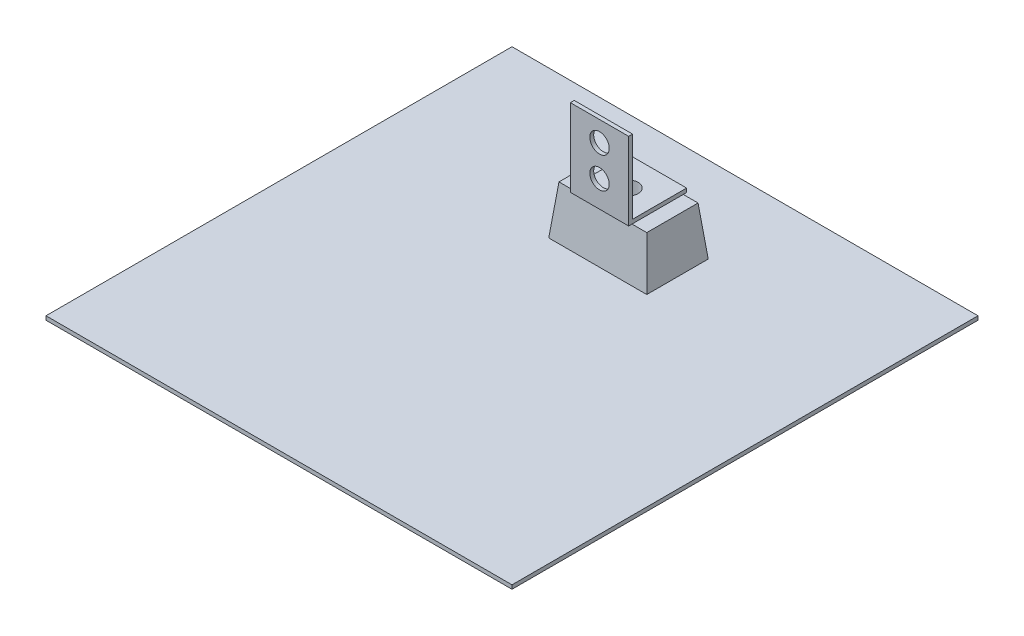
ISO-10303-21;
HEADER;
FILE_DESCRIPTION(('STEP AP214'),'2;1');
FILE_NAME('part.step','',(''),(''),'','','');
FILE_SCHEMA(('AUTOMOTIVE_DESIGN { 1 0 10303 214 1 1 1 1 }'));
ENDSEC;
DATA;
#1=APPLICATION_CONTEXT('core data for automotive mechanical design processes');
#2=APPLICATION_PROTOCOL_DEFINITION('international standard','automotive_design',2000,#1);
#3=PRODUCT_CONTEXT('',#1,'mechanical');
#4=PRODUCT('Part','Part','',(#3));
#5=PRODUCT_RELATED_PRODUCT_CATEGORY('part','',(#4));
#6=PRODUCT_DEFINITION_FORMATION('','',#4);
#7=PRODUCT_DEFINITION_CONTEXT('part definition',#1,'design');
#8=PRODUCT_DEFINITION('design','',#6,#7);
#9=PRODUCT_DEFINITION_SHAPE('','',#8);
#10=(LENGTH_UNIT() NAMED_UNIT(*) SI_UNIT(.MILLI.,.METRE.));
#11=(NAMED_UNIT(*) PLANE_ANGLE_UNIT() SI_UNIT($,.RADIAN.));
#12=(NAMED_UNIT(*) SI_UNIT($,.STERADIAN.) SOLID_ANGLE_UNIT());
#13=UNCERTAINTY_MEASURE_WITH_UNIT(LENGTH_MEASURE(1.E-05),#10,'distance_accuracy_value','');
#14=(GEOMETRIC_REPRESENTATION_CONTEXT(3) GLOBAL_UNCERTAINTY_ASSIGNED_CONTEXT((#13)) GLOBAL_UNIT_ASSIGNED_CONTEXT((#10,
#11,#12)) REPRESENTATION_CONTEXT('',''));
#15=CARTESIAN_POINT('',(0.,0.,0.));
#16=DIRECTION('',(0.,0.,1.));
#17=DIRECTION('',(1.,0.,0.));
#18=AXIS2_PLACEMENT_3D('',#15,#16,#17);
#19=CARTESIAN_POINT('',(0.,34.29,0.));
#20=DIRECTION('',(0.,-1.,0.));
#21=DIRECTION('',(0.,0.,-1.));
#22=AXIS2_PLACEMENT_3D('',#19,#20,#21);
#23=PLANE('',#22);
#24=DIRECTION('',(0.,0.,-1.));
#25=VECTOR('',#24,1.);
#26=CARTESIAN_POINT('',(171.45,34.29,-209.648741009424));
#27=LINE('',#26,#25);
#28=CARTESIAN_POINT('',(171.45,34.29,-211.830517437258));
#29=VERTEX_POINT('',#28);
#30=CARTESIAN_POINT('',(171.45,34.29,-245.369482562742));
#31=VERTEX_POINT('',#30);
#32=EDGE_CURVE('E11',#29,#31,#27,.T.);
#33=ORIENTED_EDGE('',*,*,#32,.F.);
#34=DIRECTION('',(-1.,0.,0.));
#35=VECTOR('',#34,1.);
#36=CARTESIAN_POINT('',(0.,34.29,-211.830517437258));
#37=LINE('',#36,#35);
#38=CARTESIAN_POINT('',(181.117842591182,34.29,-211.830517437258));
#39=VERTEX_POINT('',#38);
#40=EDGE_CURVE('E280',#29,#39,#37,.F.);
#41=ORIENTED_EDGE('',*,*,#40,.T.);
#42=DIRECTION('',(0.,0.,1.));
#43=VECTOR('',#42,1.);
#44=CARTESIAN_POINT('',(181.117842591182,34.29,0.));
#45=LINE('',#44,#43);
#46=CARTESIAN_POINT('',(181.117842591182,34.29,-245.369482562742));
#47=VERTEX_POINT('',#46);
#48=EDGE_CURVE('E250',#39,#47,#45,.F.);
#49=ORIENTED_EDGE('',*,*,#48,.T.);
#50=DIRECTION('',(1.,0.,0.));
#51=VECTOR('',#50,1.);
#52=CARTESIAN_POINT('',(0.,34.29,-245.369482562742));
#53=LINE('',#52,#51);
#54=EDGE_CURVE('E272',#47,#31,#53,.F.);
#55=ORIENTED_EDGE('',*,*,#54,.T.);
#56=EDGE_LOOP('',(#33,#41,#49,#55));
#57=FACE_BOUND('',#56,.T.);
#58=ADVANCED_FACE('F39',(#57),#23,.F.);
#59=CARTESIAN_POINT('',(0.,2.54,0.));
#60=DIRECTION('',(0.,-1.,0.));
#61=DIRECTION('',(0.,0.,-1.));
#62=AXIS2_PLACEMENT_3D('',#59,#60,#61);
#63=PLANE('',#62);
#64=DIRECTION('',(0.,0.,1.));
#65=VECTOR('',#64,1.);
#66=CARTESIAN_POINT('',(0.,2.54,0.));
#67=LINE('',#66,#65);
#68=CARTESIAN_POINT('',(0.,2.54,-304.8));
#69=VERTEX_POINT('',#68);
#70=CARTESIAN_POINT('',(0.,2.54,0.));
#71=VERTEX_POINT('',#70);
#72=EDGE_CURVE('E285',#69,#71,#67,.T.);
#73=ORIENTED_EDGE('',*,*,#72,.T.);
#74=DIRECTION('',(1.,0.,0.));
#75=VECTOR('',#74,1.);
#76=CARTESIAN_POINT('',(0.,2.54,0.));
#77=LINE('',#76,#75);
#78=CARTESIAN_POINT('',(304.8,2.54,0.));
#79=VERTEX_POINT('',#78);
#80=EDGE_CURVE('E289',#71,#79,#77,.T.);
#81=ORIENTED_EDGE('',*,*,#80,.T.);
#82=DIRECTION('',(0.,0.,-1.));
#83=VECTOR('',#82,1.);
#84=CARTESIAN_POINT('',(304.8,2.54,0.));
#85=LINE('',#84,#83);
#86=CARTESIAN_POINT('',(304.8,2.54,-304.8));
#87=VERTEX_POINT('',#86);
#88=EDGE_CURVE('E293',#79,#87,#85,.T.);
#89=ORIENTED_EDGE('',*,*,#88,.T.);
#90=DIRECTION('',(-1.,0.,0.));
#91=VECTOR('',#90,1.);
#92=CARTESIAN_POINT('',(0.,2.54,-304.8));
#93=LINE('',#92,#91);
#94=EDGE_CURVE('E296',#87,#69,#93,.T.);
#95=ORIENTED_EDGE('',*,*,#94,.T.);
#96=EDGE_LOOP('',(#73,#81,#89,#95));
#97=FACE_BOUND('',#96,.T.);
#98=DIRECTION('',(0.,0.,-1.));
#99=VECTOR('',#98,1.);
#100=CARTESIAN_POINT('',(184.454902060867,2.54,-208.493457967573));
#101=LINE('',#100,#99);
#102=CARTESIAN_POINT('',(184.454902060867,2.54,-208.493457967573));
#103=VERTEX_POINT('',#102);
#104=CARTESIAN_POINT('',(184.454902060867,2.54,-248.706542032427));
#105=VERTEX_POINT('',#104);
#106=EDGE_CURVE('E225',#103,#105,#101,.T.);
#107=ORIENTED_EDGE('',*,*,#106,.F.);
#108=DIRECTION('',(1.,0.,0.));
#109=VECTOR('',#108,1.);
#110=CARTESIAN_POINT('',(120.345097939133,2.54,-208.493457967573));
#111=LINE('',#110,#109);
#112=CARTESIAN_POINT('',(120.345097939133,2.54,-208.493457967573));
#113=VERTEX_POINT('',#112);
#114=EDGE_CURVE('E246',#113,#103,#111,.T.);
#115=ORIENTED_EDGE('',*,*,#114,.F.);
#116=DIRECTION('',(0.,0.,1.));
#117=VECTOR('',#116,1.);
#118=CARTESIAN_POINT('',(120.345097939133,2.54,-208.493457967573));
#119=LINE('',#118,#117);
#120=CARTESIAN_POINT('',(120.345097939133,2.54,-248.706542032427));
#121=VERTEX_POINT('',#120);
#122=EDGE_CURVE('E242',#121,#113,#119,.T.);
#123=ORIENTED_EDGE('',*,*,#122,.F.);
#124=DIRECTION('',(-1.,0.,0.));
#125=VECTOR('',#124,1.);
#126=CARTESIAN_POINT('',(120.345097939133,2.54,-248.706542032427));
#127=LINE('',#126,#125);
#128=EDGE_CURVE('E67',#105,#121,#127,.T.);
#129=ORIENTED_EDGE('',*,*,#128,.F.);
#130=EDGE_LOOP('',(#107,#115,#123,#129));
#131=FACE_BOUND('',#130,.T.);
#132=ADVANCED_FACE('F363',(#97,#131),#63,.F.);
#133=CARTESIAN_POINT('',(0.,2.54,0.));
#134=DIRECTION('',(1.,0.,0.));
#135=DIRECTION('',(0.,0.,-1.));
#136=AXIS2_PLACEMENT_3D('',#133,#134,#135);
#137=PLANE('',#136);
#138=DIRECTION('',(0.,0.,1.));
#139=VECTOR('',#138,1.);
#140=CARTESIAN_POINT('',(0.,0.,0.));
#141=LINE('',#140,#139);
#142=CARTESIAN_POINT('',(0.,0.,-304.8));
#143=VERTEX_POINT('',#142);
#144=CARTESIAN_POINT('',(0.,0.,0.));
#145=VERTEX_POINT('',#144);
#146=EDGE_CURVE('E254',#143,#145,#141,.T.);
#147=ORIENTED_EDGE('',*,*,#146,.T.);
#148=DIRECTION('',(0.,-1.,0.));
#149=VECTOR('',#148,1.);
#150=CARTESIAN_POINT('',(0.,2.54,0.));
#151=LINE('',#150,#149);
#152=EDGE_CURVE('E322',#71,#145,#151,.T.);
#153=ORIENTED_EDGE('',*,*,#152,.F.);
#154=ORIENTED_EDGE('',*,*,#72,.F.);
#155=DIRECTION('',(0.,-1.,0.));
#156=VECTOR('',#155,1.);
#157=CARTESIAN_POINT('',(0.,2.54,-304.8));
#158=LINE('',#157,#156);
#159=EDGE_CURVE('E299',#69,#143,#158,.T.);
#160=ORIENTED_EDGE('',*,*,#159,.T.);
#161=EDGE_LOOP('',(#147,#153,#154,#160));
#162=FACE_BOUND('',#161,.T.);
#163=ADVANCED_FACE('F41',(#162),#137,.F.);
#164=CARTESIAN_POINT('',(0.,2.54,0.));
#165=DIRECTION('',(0.,0.,-1.));
#166=DIRECTION('',(-1.,0.,0.));
#167=AXIS2_PLACEMENT_3D('',#164,#165,#166);
#168=PLANE('',#167);
#169=DIRECTION('',(1.,0.,0.));
#170=VECTOR('',#169,1.);
#171=CARTESIAN_POINT('',(0.,0.,0.));
#172=LINE('',#171,#170);
#173=CARTESIAN_POINT('',(304.8,0.,0.));
#174=VERTEX_POINT('',#173);
#175=EDGE_CURVE('E303',#145,#174,#172,.T.);
#176=ORIENTED_EDGE('',*,*,#175,.T.);
#177=DIRECTION('',(0.,-1.,0.));
#178=VECTOR('',#177,1.);
#179=CARTESIAN_POINT('',(304.8,2.54,0.));
#180=LINE('',#179,#178);
#181=EDGE_CURVE('E318',#79,#174,#180,.T.);
#182=ORIENTED_EDGE('',*,*,#181,.F.);
#183=ORIENTED_EDGE('',*,*,#80,.F.);
#184=ORIENTED_EDGE('',*,*,#152,.T.);
#185=EDGE_LOOP('',(#176,#182,#183,#184));
#186=FACE_BOUND('',#185,.T.);
#187=ADVANCED_FACE('F430',(#186),#168,.F.);
#188=CARTESIAN_POINT('',(304.8,2.54,0.));
#189=DIRECTION('',(-1.,0.,0.));
#190=DIRECTION('',(0.,0.,1.));
#191=AXIS2_PLACEMENT_3D('',#188,#189,#190);
#192=PLANE('',#191);
#193=DIRECTION('',(0.,0.,-1.));
#194=VECTOR('',#193,1.);
#195=CARTESIAN_POINT('',(304.8,0.,0.));
#196=LINE('',#195,#194);
#197=CARTESIAN_POINT('',(304.8,0.,-304.8));
#198=VERTEX_POINT('',#197);
#199=EDGE_CURVE('E306',#174,#198,#196,.T.);
#200=ORIENTED_EDGE('',*,*,#199,.T.);
#201=DIRECTION('',(0.,-1.,0.));
#202=VECTOR('',#201,1.);
#203=CARTESIAN_POINT('',(304.8,2.54,-304.8));
#204=LINE('',#203,#202);
#205=EDGE_CURVE('E314',#87,#198,#204,.T.);
#206=ORIENTED_EDGE('',*,*,#205,.F.);
#207=ORIENTED_EDGE('',*,*,#88,.F.);
#208=ORIENTED_EDGE('',*,*,#181,.T.);
#209=EDGE_LOOP('',(#200,#206,#207,#208));
#210=FACE_BOUND('',#209,.T.);
#211=ADVANCED_FACE('F427',(#210),#192,.F.);
#212=CARTESIAN_POINT('',(0.,2.54,-304.8));
#213=DIRECTION('',(0.,0.,1.));
#214=DIRECTION('',(1.,0.,0.));
#215=AXIS2_PLACEMENT_3D('',#212,#213,#214);
#216=PLANE('',#215);
#217=DIRECTION('',(-1.,0.,0.));
#218=VECTOR('',#217,1.);
#219=CARTESIAN_POINT('',(0.,0.,-304.8));
#220=LINE('',#219,#218);
#221=EDGE_CURVE('E290',#198,#143,#220,.T.);
#222=ORIENTED_EDGE('',*,*,#221,.T.);
#223=ORIENTED_EDGE('',*,*,#159,.F.);
#224=ORIENTED_EDGE('',*,*,#94,.F.);
#225=ORIENTED_EDGE('',*,*,#205,.T.);
#226=EDGE_LOOP('',(#222,#223,#224,#225));
#227=FACE_BOUND('',#226,.T.);
#228=ADVANCED_FACE('F423',(#227),#216,.F.);
#229=CARTESIAN_POINT('',(0.,0.,0.));
#230=DIRECTION('',(0.,-1.,0.));
#231=DIRECTION('',(0.,0.,-1.));
#232=AXIS2_PLACEMENT_3D('',#229,#230,#231);
#233=PLANE('',#232);
#234=CARTESIAN_POINT('',(152.4,0.,-228.6));
#235=DIRECTION('',(0.,-1.,0.));
#236=DIRECTION('',(0.,0.,-1.));
#237=AXIS2_PLACEMENT_3D('',#234,#235,#236);
#238=CIRCLE('',#237,6.34999999999999);
#239=CARTESIAN_POINT('',(152.4,0.,-234.95));
#240=VERTEX_POINT('',#239);
#241=EDGE_CURVE('E183',#240,#240,#238,.T.);
#242=ORIENTED_EDGE('',*,*,#241,.F.);
#243=EDGE_LOOP('',(#242));
#244=FACE_BOUND('',#243,.T.);
#245=ORIENTED_EDGE('',*,*,#146,.F.);
#246=ORIENTED_EDGE('',*,*,#221,.F.);
#247=ORIENTED_EDGE('',*,*,#199,.F.);
#248=ORIENTED_EDGE('',*,*,#175,.F.);
#249=EDGE_LOOP('',(#245,#246,#247,#248));
#250=FACE_BOUND('',#249,.T.);
#251=ADVANCED_FACE('F420',(#244,#250),#233,.T.);
#252=CARTESIAN_POINT('',(184.454902060867,2.54,-208.493457967573));
#253=DIRECTION('',(0.994521895368273,0.104528463267653,0.));
#254=DIRECTION('',(-0.104528463267653,0.994521895368273,0.));
#255=AXIS2_PLACEMENT_3D('',#252,#253,#254);
#256=PLANE('',#255);
#257=ORIENTED_EDGE('',*,*,#106,.T.);
#258=DIRECTION('',(0.103962051184498,-0.989132844377854,-0.103962051184498));
#259=VECTOR('',#258,1.);
#260=CARTESIAN_POINT('',(183.761996368515,9.13255728943549,-248.013636340076));
#261=LINE('',#260,#259);
#262=EDGE_CURVE('E251',#47,#105,#261,.T.);
#263=ORIENTED_EDGE('',*,*,#262,.F.);
#264=ORIENTED_EDGE('',*,*,#48,.F.);
#265=DIRECTION('',(0.103962051184498,-0.989132844377854,0.103962051184498));
#266=VECTOR('',#265,1.);
#267=CARTESIAN_POINT('',(184.454902060867,2.54,-208.493457967573));
#268=LINE('',#267,#266);
#269=EDGE_CURVE('E256',#39,#103,#268,.T.);
#270=ORIENTED_EDGE('',*,*,#269,.T.);
#271=EDGE_LOOP('',(#257,#263,#264,#270));
#272=FACE_BOUND('',#271,.T.);
#273=ADVANCED_FACE('F404',(#272),#256,.T.);
#274=CARTESIAN_POINT('',(120.345097939133,2.54,-248.706542032427));
#275=DIRECTION('',(0.,0.104528463267653,-0.994521895368273));
#276=DIRECTION('',(0.,0.994521895368273,0.104528463267653));
#277=AXIS2_PLACEMENT_3D('',#274,#275,#276);
#278=PLANE('',#277);
#279=ORIENTED_EDGE('',*,*,#128,.T.);
#280=DIRECTION('',(-0.103962051184498,-0.989132844377854,-0.103962051184498));
#281=VECTOR('',#280,1.);
#282=CARTESIAN_POINT('',(120.779725298197,6.67520309591098,-248.271914673363));
#283=LINE('',#282,#281);
#284=CARTESIAN_POINT('',(123.682157408818,34.29,-245.369482562742));
#285=VERTEX_POINT('',#284);
#286=EDGE_CURVE('E255',#285,#121,#283,.T.);
#287=ORIENTED_EDGE('',*,*,#286,.F.);
#288=CARTESIAN_POINT('',(133.35,34.29,-245.369482562742));
#289=VERTEX_POINT('',#288);
#290=EDGE_CURVE('E271',#289,#285,#53,.F.);
#291=ORIENTED_EDGE('',*,*,#290,.F.);
#292=EDGE_CURVE('E277',#31,#289,#53,.F.);
#293=ORIENTED_EDGE('',*,*,#292,.F.);
#294=ORIENTED_EDGE('',*,*,#54,.F.);
#295=ORIENTED_EDGE('',*,*,#262,.T.);
#296=EDGE_LOOP('',(#279,#287,#291,#293,#294,#295));
#297=FACE_BOUND('',#296,.T.);
#298=ADVANCED_FACE('F406',(#297),#278,.T.);
#299=CARTESIAN_POINT('',(120.345097939133,2.54,-208.493457967573));
#300=DIRECTION('',(-0.994521895368273,0.104528463267653,0.));
#301=DIRECTION('',(-0.104528463267653,-0.994521895368273,0.));
#302=AXIS2_PLACEMENT_3D('',#299,#300,#301);
#303=PLANE('',#302);
#304=ORIENTED_EDGE('',*,*,#122,.T.);
#305=DIRECTION('',(-0.103962051184498,-0.989132844377854,0.103962051184498));
#306=VECTOR('',#305,1.);
#307=CARTESIAN_POINT('',(120.345097939133,2.54,-208.493457967573));
#308=LINE('',#307,#306);
#309=CARTESIAN_POINT('',(123.682157408818,34.29,-211.830517437258));
#310=VERTEX_POINT('',#309);
#311=EDGE_CURVE('E260',#310,#113,#308,.T.);
#312=ORIENTED_EDGE('',*,*,#311,.F.);
#313=DIRECTION('',(0.,0.,-1.));
#314=VECTOR('',#313,1.);
#315=CARTESIAN_POINT('',(123.682157408818,34.29,0.));
#316=LINE('',#315,#314);
#317=EDGE_CURVE('E276',#285,#310,#316,.F.);
#318=ORIENTED_EDGE('',*,*,#317,.F.);
#319=ORIENTED_EDGE('',*,*,#286,.T.);
#320=EDGE_LOOP('',(#304,#312,#318,#319));
#321=FACE_BOUND('',#320,.T.);
#322=ADVANCED_FACE('F386',(#321),#303,.T.);
#323=CARTESIAN_POINT('',(120.345097939133,2.54,-208.493457967573));
#324=DIRECTION('',(0.,0.104528463267653,0.994521895368273));
#325=DIRECTION('',(0.,-0.994521895368273,0.104528463267653));
#326=AXIS2_PLACEMENT_3D('',#323,#324,#325);
#327=PLANE('',#326);
#328=ORIENTED_EDGE('',*,*,#114,.T.);
#329=ORIENTED_EDGE('',*,*,#269,.F.);
#330=ORIENTED_EDGE('',*,*,#40,.F.);
#331=CARTESIAN_POINT('',(133.35,34.29,-211.830517437258));
#332=VERTEX_POINT('',#331);
#333=EDGE_CURVE('E284',#332,#29,#37,.F.);
#334=ORIENTED_EDGE('',*,*,#333,.F.);
#335=EDGE_CURVE('E261',#310,#332,#37,.F.);
#336=ORIENTED_EDGE('',*,*,#335,.F.);
#337=ORIENTED_EDGE('',*,*,#311,.T.);
#338=EDGE_LOOP('',(#328,#329,#330,#334,#336,#337));
#339=FACE_BOUND('',#338,.T.);
#340=ADVANCED_FACE('F378',(#339),#327,.T.);
#341=ORIENTED_EDGE('',*,*,#335,.T.);
#342=DIRECTION('',(0.,0.,-1.));
#343=VECTOR('',#342,1.);
#344=CARTESIAN_POINT('',(133.35,34.29,-209.648741009424));
#345=LINE('',#344,#343);
#346=EDGE_CURVE('E49',#332,#289,#345,.T.);
#347=ORIENTED_EDGE('',*,*,#346,.T.);
#348=ORIENTED_EDGE('',*,*,#290,.T.);
#349=ORIENTED_EDGE('',*,*,#317,.T.);
#350=EDGE_LOOP('',(#341,#347,#348,#349));
#351=FACE_BOUND('',#350,.T.);
#352=ADVANCED_FACE('F366',(#351),#23,.F.);
#353=CARTESIAN_POINT('',(171.45,0.,0.));
#354=DIRECTION('',(1.,0.,0.));
#355=DIRECTION('',(0.,0.,-1.));
#356=AXIS2_PLACEMENT_3D('',#353,#354,#355);
#357=PLANE('',#356);
#358=DIRECTION('',(0.,1.,0.));
#359=VECTOR('',#358,1.);
#360=CARTESIAN_POINT('',(171.45,36.83,-247.551258990576));
#361=LINE('',#360,#359);
#362=CARTESIAN_POINT('',(171.45,34.29,-247.551258990576));
#363=VERTEX_POINT('',#362);
#364=CARTESIAN_POINT('',(171.45,36.83,-247.551258990576));
#365=VERTEX_POINT('',#364);
#366=EDGE_CURVE('E162',#363,#365,#361,.T.);
#367=ORIENTED_EDGE('',*,*,#366,.T.);
#368=DIRECTION('',(0.,0.,1.));
#369=VECTOR('',#368,1.);
#370=CARTESIAN_POINT('',(171.45,36.83,-212.188741009424));
#371=LINE('',#370,#369);
#372=CARTESIAN_POINT('',(171.45,36.83,-212.188741009424));
#373=VERTEX_POINT('',#372);
#374=EDGE_CURVE('E172',#365,#373,#371,.T.);
#375=ORIENTED_EDGE('',*,*,#374,.T.);
#376=DIRECTION('',(0.,1.,0.));
#377=VECTOR('',#376,1.);
#378=CARTESIAN_POINT('',(171.45,36.83,-212.188741009424));
#379=LINE('',#378,#377);
#380=CARTESIAN_POINT('',(171.45,85.09,-212.188741009424));
#381=VERTEX_POINT('',#380);
#382=EDGE_CURVE('E178',#373,#381,#379,.T.);
#383=ORIENTED_EDGE('',*,*,#382,.T.);
#384=DIRECTION('',(0.,0.,1.));
#385=VECTOR('',#384,1.);
#386=CARTESIAN_POINT('',(171.45,85.09,-209.648741009424));
#387=LINE('',#386,#385);
#388=CARTESIAN_POINT('',(171.45,85.09,-209.648741009424));
#389=VERTEX_POINT('',#388);
#390=EDGE_CURVE('E193',#381,#389,#387,.T.);
#391=ORIENTED_EDGE('',*,*,#390,.T.);
#392=DIRECTION('',(0.,-1.,0.));
#393=VECTOR('',#392,1.);
#394=CARTESIAN_POINT('',(171.45,34.29,-209.648741009424));
#395=LINE('',#394,#393);
#396=CARTESIAN_POINT('',(171.45,34.29,-209.648741009424));
#397=VERTEX_POINT('',#396);
#398=EDGE_CURVE('E197',#389,#397,#395,.T.);
#399=ORIENTED_EDGE('',*,*,#398,.T.);
#400=EDGE_CURVE('E51',#397,#29,#27,.T.);
#401=ORIENTED_EDGE('',*,*,#400,.T.);
#402=ORIENTED_EDGE('',*,*,#32,.T.);
#403=EDGE_CURVE('E52',#31,#363,#27,.T.);
#404=ORIENTED_EDGE('',*,*,#403,.T.);
#405=EDGE_LOOP('',(#367,#375,#383,#391,#399,#401,#402,#404));
#406=FACE_BOUND('',#405,.T.);
#407=ADVANCED_FACE('F180',(#406),#357,.T.);
#408=CARTESIAN_POINT('',(133.35,0.,0.));
#409=DIRECTION('',(1.,0.,0.));
#410=DIRECTION('',(0.,0.,-1.));
#411=AXIS2_PLACEMENT_3D('',#408,#409,#410);
#412=PLANE('',#411);
#413=DIRECTION('',(0.,1.,0.));
#414=VECTOR('',#413,1.);
#415=CARTESIAN_POINT('',(133.35,36.83,-247.551258990576));
#416=LINE('',#415,#414);
#417=CARTESIAN_POINT('',(133.35,34.29,-247.551258990576));
#418=VERTEX_POINT('',#417);
#419=CARTESIAN_POINT('',(133.35,36.83,-247.551258990576));
#420=VERTEX_POINT('',#419);
#421=EDGE_CURVE('E163',#418,#420,#416,.T.);
#422=ORIENTED_EDGE('',*,*,#421,.F.);
#423=EDGE_CURVE('E59',#289,#418,#345,.T.);
#424=ORIENTED_EDGE('',*,*,#423,.F.);
#425=ORIENTED_EDGE('',*,*,#346,.F.);
#426=CARTESIAN_POINT('',(133.35,34.29,-209.648741009424));
#427=VERTEX_POINT('',#426);
#428=EDGE_CURVE('E169',#427,#332,#345,.T.);
#429=ORIENTED_EDGE('',*,*,#428,.F.);
#430=DIRECTION('',(0.,-1.,0.));
#431=VECTOR('',#430,1.);
#432=CARTESIAN_POINT('',(133.35,34.29,-209.648741009424));
#433=LINE('',#432,#431);
#434=CARTESIAN_POINT('',(133.35,85.09,-209.648741009424));
#435=VERTEX_POINT('',#434);
#436=EDGE_CURVE('E215',#435,#427,#433,.T.);
#437=ORIENTED_EDGE('',*,*,#436,.F.);
#438=DIRECTION('',(0.,0.,1.));
#439=VECTOR('',#438,1.);
#440=CARTESIAN_POINT('',(133.35,85.09,-209.648741009424));
#441=LINE('',#440,#439);
#442=CARTESIAN_POINT('',(133.35,85.09,-212.188741009424));
#443=VERTEX_POINT('',#442);
#444=EDGE_CURVE('E211',#443,#435,#441,.T.);
#445=ORIENTED_EDGE('',*,*,#444,.F.);
#446=DIRECTION('',(0.,1.,0.));
#447=VECTOR('',#446,1.);
#448=CARTESIAN_POINT('',(133.35,36.83,-212.188741009424));
#449=LINE('',#448,#447);
#450=CARTESIAN_POINT('',(133.35,36.83,-212.188741009424));
#451=VERTEX_POINT('',#450);
#452=EDGE_CURVE('E208',#451,#443,#449,.T.);
#453=ORIENTED_EDGE('',*,*,#452,.F.);
#454=DIRECTION('',(0.,0.,1.));
#455=VECTOR('',#454,1.);
#456=CARTESIAN_POINT('',(133.35,36.83,-212.188741009424));
#457=LINE('',#456,#455);
#458=EDGE_CURVE('E205',#420,#451,#457,.T.);
#459=ORIENTED_EDGE('',*,*,#458,.F.);
#460=EDGE_LOOP('',(#422,#424,#425,#429,#437,#445,#453,#459));
#461=FACE_BOUND('',#460,.T.);
#462=ADVANCED_FACE('F351',(#461),#412,.F.);
#463=CARTESIAN_POINT('',(133.35,36.83,-212.188741009424));
#464=DIRECTION('',(0.,1.,0.));
#465=DIRECTION('',(0.,0.,1.));
#466=AXIS2_PLACEMENT_3D('',#463,#464,#465);
#467=PLANE('',#466);
#468=CARTESIAN_POINT('',(152.4,36.83,-228.6));
#469=DIRECTION('',(0.,1.,0.));
#470=DIRECTION('',(0.,0.,1.));
#471=AXIS2_PLACEMENT_3D('',#468,#469,#470);
#472=CIRCLE('',#471,6.34999999999999);
#473=CARTESIAN_POINT('',(152.4,36.83,-222.25));
#474=VERTEX_POINT('',#473);
#475=EDGE_CURVE('E187',#474,#474,#472,.T.);
#476=ORIENTED_EDGE('',*,*,#475,.F.);
#477=EDGE_LOOP('',(#476));
#478=FACE_BOUND('',#477,.T.);
#479=DIRECTION('',(1.,0.,0.));
#480=VECTOR('',#479,1.);
#481=CARTESIAN_POINT('',(133.35,36.83,-212.188741009424));
#482=LINE('',#481,#480);
#483=EDGE_CURVE('E168',#451,#373,#482,.T.);
#484=ORIENTED_EDGE('',*,*,#483,.T.);
#485=ORIENTED_EDGE('',*,*,#374,.F.);
#486=DIRECTION('',(1.,0.,0.));
#487=VECTOR('',#486,1.);
#488=CARTESIAN_POINT('',(133.35,36.83,-247.551258990576));
#489=LINE('',#488,#487);
#490=EDGE_CURVE('E157',#420,#365,#489,.T.);
#491=ORIENTED_EDGE('',*,*,#490,.F.);
#492=ORIENTED_EDGE('',*,*,#458,.T.);
#493=EDGE_LOOP('',(#484,#485,#491,#492));
#494=FACE_BOUND('',#493,.T.);
#495=ADVANCED_FACE('F173',(#478,#494),#467,.T.);
#496=CARTESIAN_POINT('',(133.35,85.09,-212.188741009424));
#497=DIRECTION('',(0.,0.,-1.));
#498=DIRECTION('',(-1.,0.,0.));
#499=AXIS2_PLACEMENT_3D('',#496,#497,#498);
#500=PLANE('',#499);
#501=CARTESIAN_POINT('',(152.4,71.8646658450187,-212.188741009424));
#502=DIRECTION('',(0.,0.,-1.));
#503=DIRECTION('',(-1.,0.,0.));
#504=AXIS2_PLACEMENT_3D('',#501,#502,#503);
#505=CIRCLE('',#504,6.34999999999999);
#506=CARTESIAN_POINT('',(146.05,71.8646658450187,-212.188741009424));
#507=VERTEX_POINT('',#506);
#508=EDGE_CURVE('E328',#507,#507,#505,.T.);
#509=ORIENTED_EDGE('',*,*,#508,.F.);
#510=EDGE_LOOP('',(#509));
#511=FACE_BOUND('',#510,.T.);
#512=CARTESIAN_POINT('',(152.4,51.5446658450187,-212.188741009424));
#513=DIRECTION('',(0.,0.,-1.));
#514=DIRECTION('',(-1.,0.,0.));
#515=AXIS2_PLACEMENT_3D('',#512,#513,#514);
#516=CIRCLE('',#515,6.35);
#517=CARTESIAN_POINT('',(146.05,51.5446658450187,-212.188741009424));
#518=VERTEX_POINT('',#517);
#519=EDGE_CURVE('E335',#518,#518,#516,.T.);
#520=ORIENTED_EDGE('',*,*,#519,.F.);
#521=EDGE_LOOP('',(#520));
#522=FACE_BOUND('',#521,.T.);
#523=DIRECTION('',(1.,0.,0.));
#524=VECTOR('',#523,1.);
#525=CARTESIAN_POINT('',(133.35,85.09,-212.188741009424));
#526=LINE('',#525,#524);
#527=EDGE_CURVE('E232',#443,#381,#526,.T.);
#528=ORIENTED_EDGE('',*,*,#527,.T.);
#529=ORIENTED_EDGE('',*,*,#382,.F.);
#530=ORIENTED_EDGE('',*,*,#483,.F.);
#531=ORIENTED_EDGE('',*,*,#452,.T.);
#532=EDGE_LOOP('',(#528,#529,#530,#531));
#533=FACE_BOUND('',#532,.T.);
#534=ADVANCED_FACE('F350',(#511,#522,#533),#500,.T.);
#535=CARTESIAN_POINT('',(133.35,85.09,-209.648741009424));
#536=DIRECTION('',(0.,1.,0.));
#537=DIRECTION('',(0.,0.,1.));
#538=AXIS2_PLACEMENT_3D('',#535,#536,#537);
#539=PLANE('',#538);
#540=DIRECTION('',(1.,0.,0.));
#541=VECTOR('',#540,1.);
#542=CARTESIAN_POINT('',(133.35,85.09,-209.648741009424));
#543=LINE('',#542,#541);
#544=EDGE_CURVE('E229',#435,#389,#543,.T.);
#545=ORIENTED_EDGE('',*,*,#544,.T.);
#546=ORIENTED_EDGE('',*,*,#390,.F.);
#547=ORIENTED_EDGE('',*,*,#527,.F.);
#548=ORIENTED_EDGE('',*,*,#444,.T.);
#549=EDGE_LOOP('',(#545,#546,#547,#548));
#550=FACE_BOUND('',#549,.T.);
#551=ADVANCED_FACE('F357',(#550),#539,.T.);
#552=CARTESIAN_POINT('',(133.35,34.29,-209.648741009424));
#553=DIRECTION('',(0.,0.,1.));
#554=DIRECTION('',(1.,0.,0.));
#555=AXIS2_PLACEMENT_3D('',#552,#553,#554);
#556=PLANE('',#555);
#557=CARTESIAN_POINT('',(152.4,71.8646658450187,-209.648741009424));
#558=DIRECTION('',(0.,0.,1.));
#559=DIRECTION('',(1.,0.,0.));
#560=AXIS2_PLACEMENT_3D('',#557,#558,#559);
#561=CIRCLE('',#560,6.34999999999999);
#562=CARTESIAN_POINT('',(158.75,71.8646658450187,-209.648741009424));
#563=VERTEX_POINT('',#562);
#564=EDGE_CURVE('E43',#563,#563,#561,.T.);
#565=ORIENTED_EDGE('',*,*,#564,.F.);
#566=EDGE_LOOP('',(#565));
#567=FACE_BOUND('',#566,.T.);
#568=CARTESIAN_POINT('',(152.4,51.5446658450187,-209.648741009424));
#569=DIRECTION('',(0.,0.,1.));
#570=DIRECTION('',(1.,0.,0.));
#571=AXIS2_PLACEMENT_3D('',#568,#569,#570);
#572=CIRCLE('',#571,6.35);
#573=CARTESIAN_POINT('',(158.75,51.5446658450187,-209.648741009424));
#574=VERTEX_POINT('',#573);
#575=EDGE_CURVE('E325',#574,#574,#572,.T.);
#576=ORIENTED_EDGE('',*,*,#575,.F.);
#577=EDGE_LOOP('',(#576));
#578=FACE_BOUND('',#577,.T.);
#579=DIRECTION('',(1.,0.,0.));
#580=VECTOR('',#579,1.);
#581=CARTESIAN_POINT('',(133.35,34.29,-209.648741009424));
#582=LINE('',#581,#580);
#583=EDGE_CURVE('E226',#427,#397,#582,.T.);
#584=ORIENTED_EDGE('',*,*,#583,.T.);
#585=ORIENTED_EDGE('',*,*,#398,.F.);
#586=ORIENTED_EDGE('',*,*,#544,.F.);
#587=ORIENTED_EDGE('',*,*,#436,.T.);
#588=EDGE_LOOP('',(#584,#585,#586,#587));
#589=FACE_BOUND('',#588,.T.);
#590=ADVANCED_FACE('F531',(#567,#578,#589),#556,.T.);
#591=CARTESIAN_POINT('',(133.35,34.29,-209.648741009424));
#592=DIRECTION('',(0.,-1.,0.));
#593=DIRECTION('',(0.,0.,-1.));
#594=AXIS2_PLACEMENT_3D('',#591,#592,#593);
#595=PLANE('',#594);
#596=ORIENTED_EDGE('',*,*,#428,.T.);
#597=ORIENTED_EDGE('',*,*,#333,.T.);
#598=ORIENTED_EDGE('',*,*,#400,.F.);
#599=ORIENTED_EDGE('',*,*,#583,.F.);
#600=EDGE_LOOP('',(#596,#597,#598,#599));
#601=FACE_BOUND('',#600,.T.);
#602=ADVANCED_FACE('F540',(#601),#595,.T.);
#603=CARTESIAN_POINT('',(133.35,36.83,-247.551258990576));
#604=DIRECTION('',(0.,0.,-1.));
#605=DIRECTION('',(-1.,0.,0.));
#606=AXIS2_PLACEMENT_3D('',#603,#604,#605);
#607=PLANE('',#606);
#608=ORIENTED_EDGE('',*,*,#490,.T.);
#609=ORIENTED_EDGE('',*,*,#366,.F.);
#610=DIRECTION('',(1.,0.,0.));
#611=VECTOR('',#610,1.);
#612=CARTESIAN_POINT('',(133.35,34.29,-247.551258990576));
#613=LINE('',#612,#611);
#614=EDGE_CURVE('E222',#418,#363,#613,.T.);
#615=ORIENTED_EDGE('',*,*,#614,.F.);
#616=ORIENTED_EDGE('',*,*,#421,.T.);
#617=EDGE_LOOP('',(#608,#609,#615,#616));
#618=FACE_BOUND('',#617,.T.);
#619=ADVANCED_FACE('F159',(#618),#607,.T.);
#620=ORIENTED_EDGE('',*,*,#403,.F.);
#621=ORIENTED_EDGE('',*,*,#292,.T.);
#622=ORIENTED_EDGE('',*,*,#423,.T.);
#623=ORIENTED_EDGE('',*,*,#614,.T.);
#624=EDGE_LOOP('',(#620,#621,#622,#623));
#625=FACE_BOUND('',#624,.T.);
#626=ADVANCED_FACE('F494',(#625),#595,.T.);
#627=CARTESIAN_POINT('',(152.4,8.89,-228.6));
#628=DIRECTION('',(0.,1.,0.));
#629=DIRECTION('',(0.,0.,1.));
#630=AXIS2_PLACEMENT_3D('',#627,#628,#629);
#631=CYLINDRICAL_SURFACE('',#630,6.34999999999999);
#632=ORIENTED_EDGE('',*,*,#475,.T.);
#633=EDGE_LOOP('',(#632));
#634=FACE_BOUND('',#633,.T.);
#635=ORIENTED_EDGE('',*,*,#241,.T.);
#636=EDGE_LOOP('',(#635));
#637=FACE_BOUND('',#636,.T.);
#638=ADVANCED_FACE('F346',(#634,#637),#631,.F.);
#639=CARTESIAN_POINT('',(152.4,51.5446658450187,-193.138741009424));
#640=DIRECTION('',(0.,0.,-1.));
#641=DIRECTION('',(-1.,0.,0.));
#642=AXIS2_PLACEMENT_3D('',#639,#640,#641);
#643=CYLINDRICAL_SURFACE('',#642,6.35);
#644=ORIENTED_EDGE('',*,*,#575,.T.);
#645=EDGE_LOOP('',(#644));
#646=FACE_BOUND('',#645,.T.);
#647=ORIENTED_EDGE('',*,*,#519,.T.);
#648=EDGE_LOOP('',(#647));
#649=FACE_BOUND('',#648,.T.);
#650=ADVANCED_FACE('F493',(#646,#649),#643,.F.);
#651=CARTESIAN_POINT('',(152.4,71.8646658450187,-193.138741009424));
#652=DIRECTION('',(0.,0.,-1.));
#653=DIRECTION('',(-1.,0.,0.));
#654=AXIS2_PLACEMENT_3D('',#651,#652,#653);
#655=CYLINDRICAL_SURFACE('',#654,6.34999999999999);
#656=ORIENTED_EDGE('',*,*,#564,.T.);
#657=EDGE_LOOP('',(#656));
#658=FACE_BOUND('',#657,.T.);
#659=ORIENTED_EDGE('',*,*,#508,.T.);
#660=EDGE_LOOP('',(#659));
#661=FACE_BOUND('',#660,.T.);
#662=ADVANCED_FACE('F586',(#658,#661),#655,.F.);
#663=CLOSED_SHELL('',(#58,#132,#163,#187,#211,#228,#251,#273,#298,#322,#340,#352,#407,#462,#495,
#534,#551,#590,#602,#619,#626,#638,#650,#662));
#664=MANIFOLD_SOLID_BREP('B2',#663);
#665=ADVANCED_BREP_SHAPE_REPRESENTATION('',(#18,#664),#14);
#666=SHAPE_DEFINITION_REPRESENTATION(#9,#665);
ENDSEC;
END-ISO-10303-21;
